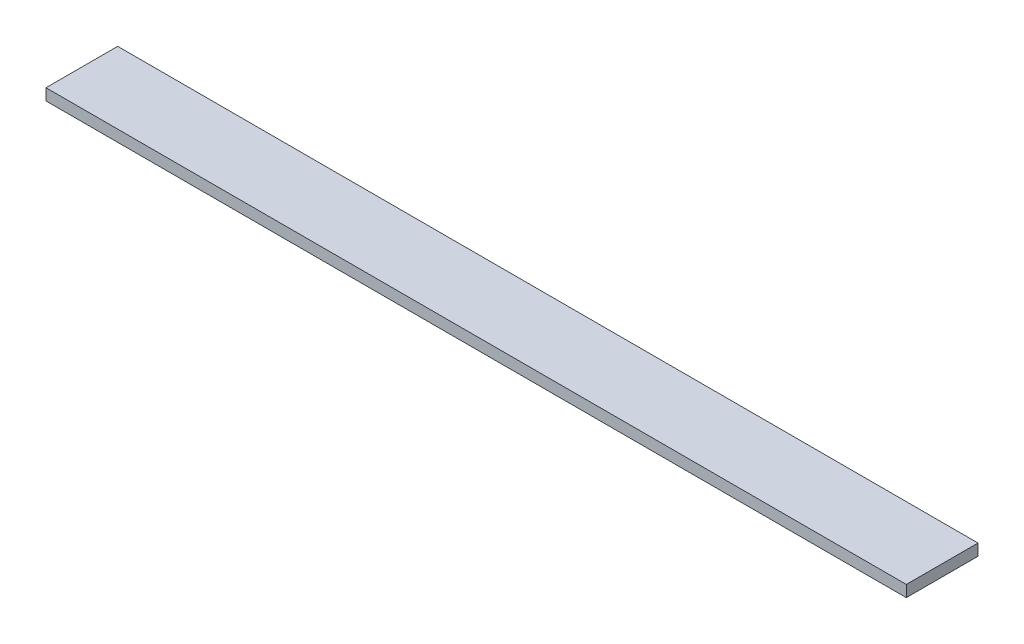
ISO-10303-21;
HEADER;
FILE_DESCRIPTION(('STEP AP214'),'2;1');
FILE_NAME('part.step','',(''),(''),'','','');
FILE_SCHEMA(('AUTOMOTIVE_DESIGN { 1 0 10303 214 1 1 1 1 }'));
ENDSEC;
DATA;
#1=APPLICATION_CONTEXT('core data for automotive mechanical design processes');
#2=APPLICATION_PROTOCOL_DEFINITION('international standard','automotive_design',2000,#1);
#3=PRODUCT_CONTEXT('',#1,'mechanical');
#4=PRODUCT('Part','Part','',(#3));
#5=PRODUCT_RELATED_PRODUCT_CATEGORY('part','',(#4));
#6=PRODUCT_DEFINITION_FORMATION('','',#4);
#7=PRODUCT_DEFINITION_CONTEXT('part definition',#1,'design');
#8=PRODUCT_DEFINITION('design','',#6,#7);
#9=PRODUCT_DEFINITION_SHAPE('','',#8);
#10=(LENGTH_UNIT() NAMED_UNIT(*) SI_UNIT(.MILLI.,.METRE.));
#11=(NAMED_UNIT(*) PLANE_ANGLE_UNIT() SI_UNIT($,.RADIAN.));
#12=(NAMED_UNIT(*) SI_UNIT($,.STERADIAN.) SOLID_ANGLE_UNIT());
#13=UNCERTAINTY_MEASURE_WITH_UNIT(LENGTH_MEASURE(1.E-05),#10,'distance_accuracy_value','');
#14=(GEOMETRIC_REPRESENTATION_CONTEXT(3) GLOBAL_UNCERTAINTY_ASSIGNED_CONTEXT((#13)) GLOBAL_UNIT_ASSIGNED_CONTEXT((#10,
#11,#12)) REPRESENTATION_CONTEXT('',''));
#15=CARTESIAN_POINT('',(0.,0.,0.));
#16=DIRECTION('',(0.,0.,1.));
#17=DIRECTION('',(1.,0.,0.));
#18=AXIS2_PLACEMENT_3D('',#15,#16,#17);
#19=CARTESIAN_POINT('',(300.,8.,-25.));
#20=DIRECTION('',(-1.,0.,0.));
#21=DIRECTION('',(0.,0.,1.));
#22=AXIS2_PLACEMENT_3D('',#19,#20,#21);
#23=PLANE('',#22);
#24=DIRECTION('',(0.,0.,-1.));
#25=VECTOR('',#24,1.);
#26=CARTESIAN_POINT('',(300.,0.,-25.));
#27=LINE('',#26,#25);
#28=CARTESIAN_POINT('',(300.,0.,25.));
#29=VERTEX_POINT('',#28);
#30=CARTESIAN_POINT('',(300.,0.,-25.));
#31=VERTEX_POINT('',#30);
#32=EDGE_CURVE('E100',#29,#31,#27,.T.);
#33=ORIENTED_EDGE('',*,*,#32,.T.);
#34=DIRECTION('',(0.,-1.,0.));
#35=VECTOR('',#34,1.);
#36=CARTESIAN_POINT('',(300.,8.,-25.));
#37=LINE('',#36,#35);
#38=CARTESIAN_POINT('',(300.,8.,-25.));
#39=VERTEX_POINT('',#38);
#40=EDGE_CURVE('E11',#39,#31,#37,.T.);
#41=ORIENTED_EDGE('',*,*,#40,.F.);
#42=DIRECTION('',(0.,0.,-1.));
#43=VECTOR('',#42,1.);
#44=CARTESIAN_POINT('',(300.,8.,-25.));
#45=LINE('',#44,#43);
#46=CARTESIAN_POINT('',(300.,8.,25.));
#47=VERTEX_POINT('',#46);
#48=EDGE_CURVE('E88',#47,#39,#45,.T.);
#49=ORIENTED_EDGE('',*,*,#48,.F.);
#50=DIRECTION('',(0.,-1.,0.));
#51=VECTOR('',#50,1.);
#52=CARTESIAN_POINT('',(300.,8.,25.));
#53=LINE('',#52,#51);
#54=EDGE_CURVE('E96',#47,#29,#53,.T.);
#55=ORIENTED_EDGE('',*,*,#54,.T.);
#56=EDGE_LOOP('',(#33,#41,#49,#55));
#57=FACE_BOUND('',#56,.T.);
#58=ADVANCED_FACE('F37',(#57),#23,.F.);
#59=CARTESIAN_POINT('',(-300.,8.,-25.));
#60=DIRECTION('',(0.,0.,1.));
#61=DIRECTION('',(1.,0.,0.));
#62=AXIS2_PLACEMENT_3D('',#59,#60,#61);
#63=PLANE('',#62);
#64=DIRECTION('',(-1.,0.,0.));
#65=VECTOR('',#64,1.);
#66=CARTESIAN_POINT('',(-300.,0.,-25.));
#67=LINE('',#66,#65);
#68=CARTESIAN_POINT('',(-300.,0.,-25.));
#69=VERTEX_POINT('',#68);
#70=EDGE_CURVE('E92',#31,#69,#67,.T.);
#71=ORIENTED_EDGE('',*,*,#70,.T.);
#72=DIRECTION('',(0.,-1.,0.));
#73=VECTOR('',#72,1.);
#74=CARTESIAN_POINT('',(-300.,8.,-25.));
#75=LINE('',#74,#73);
#76=CARTESIAN_POINT('',(-300.,8.,-25.));
#77=VERTEX_POINT('',#76);
#78=EDGE_CURVE('E45',#77,#69,#75,.T.);
#79=ORIENTED_EDGE('',*,*,#78,.F.);
#80=DIRECTION('',(-1.,0.,0.));
#81=VECTOR('',#80,1.);
#82=CARTESIAN_POINT('',(-300.,8.,-25.));
#83=LINE('',#82,#81);
#84=EDGE_CURVE('E83',#39,#77,#83,.T.);
#85=ORIENTED_EDGE('',*,*,#84,.F.);
#86=ORIENTED_EDGE('',*,*,#40,.T.);
#87=EDGE_LOOP('',(#71,#79,#85,#86));
#88=FACE_BOUND('',#87,.T.);
#89=ADVANCED_FACE('F91',(#88),#63,.F.);
#90=CARTESIAN_POINT('',(-300.,8.,-25.));
#91=DIRECTION('',(1.,0.,0.));
#92=DIRECTION('',(0.,0.,-1.));
#93=AXIS2_PLACEMENT_3D('',#90,#91,#92);
#94=PLANE('',#93);
#95=DIRECTION('',(0.,0.,1.));
#96=VECTOR('',#95,1.);
#97=CARTESIAN_POINT('',(-300.,0.,-25.));
#98=LINE('',#97,#96);
#99=CARTESIAN_POINT('',(-300.,0.,25.));
#100=VERTEX_POINT('',#99);
#101=EDGE_CURVE('E70',#69,#100,#98,.T.);
#102=ORIENTED_EDGE('',*,*,#101,.T.);
#103=DIRECTION('',(0.,-1.,0.));
#104=VECTOR('',#103,1.);
#105=CARTESIAN_POINT('',(-300.,8.,25.));
#106=LINE('',#105,#104);
#107=CARTESIAN_POINT('',(-300.,8.,25.));
#108=VERTEX_POINT('',#107);
#109=EDGE_CURVE('E93',#108,#100,#106,.T.);
#110=ORIENTED_EDGE('',*,*,#109,.F.);
#111=DIRECTION('',(0.,0.,1.));
#112=VECTOR('',#111,1.);
#113=CARTESIAN_POINT('',(-300.,8.,-25.));
#114=LINE('',#113,#112);
#115=EDGE_CURVE('E86',#77,#108,#114,.T.);
#116=ORIENTED_EDGE('',*,*,#115,.F.);
#117=ORIENTED_EDGE('',*,*,#78,.T.);
#118=EDGE_LOOP('',(#102,#110,#116,#117));
#119=FACE_BOUND('',#118,.T.);
#120=ADVANCED_FACE('F94',(#119),#94,.F.);
#121=CARTESIAN_POINT('',(-300.,8.,25.));
#122=DIRECTION('',(0.,0.,-1.));
#123=DIRECTION('',(-1.,0.,0.));
#124=AXIS2_PLACEMENT_3D('',#121,#122,#123);
#125=PLANE('',#124);
#126=DIRECTION('',(1.,0.,0.));
#127=VECTOR('',#126,1.);
#128=CARTESIAN_POINT('',(-300.,0.,25.));
#129=LINE('',#128,#127);
#130=EDGE_CURVE('E76',#100,#29,#129,.T.);
#131=ORIENTED_EDGE('',*,*,#130,.T.);
#132=ORIENTED_EDGE('',*,*,#54,.F.);
#133=DIRECTION('',(1.,0.,0.));
#134=VECTOR('',#133,1.);
#135=CARTESIAN_POINT('',(-300.,8.,25.));
#136=LINE('',#135,#134);
#137=EDGE_CURVE('E53',#108,#47,#136,.T.);
#138=ORIENTED_EDGE('',*,*,#137,.F.);
#139=ORIENTED_EDGE('',*,*,#109,.T.);
#140=EDGE_LOOP('',(#131,#132,#138,#139));
#141=FACE_BOUND('',#140,.T.);
#142=ADVANCED_FACE('F107',(#141),#125,.F.);
#143=CARTESIAN_POINT('',(0.,8.,0.));
#144=DIRECTION('',(0.,1.,0.));
#145=DIRECTION('',(0.,0.,1.));
#146=AXIS2_PLACEMENT_3D('',#143,#144,#145);
#147=PLANE('',#146);
#148=ORIENTED_EDGE('',*,*,#48,.T.);
#149=ORIENTED_EDGE('',*,*,#84,.T.);
#150=ORIENTED_EDGE('',*,*,#115,.T.);
#151=ORIENTED_EDGE('',*,*,#137,.T.);
#152=EDGE_LOOP('',(#148,#149,#150,#151));
#153=FACE_BOUND('',#152,.T.);
#154=ADVANCED_FACE('F84',(#153),#147,.T.);
#155=CARTESIAN_POINT('',(0.,0.,0.));
#156=DIRECTION('',(0.,1.,0.));
#157=DIRECTION('',(0.,0.,1.));
#158=AXIS2_PLACEMENT_3D('',#155,#156,#157);
#159=PLANE('',#158);
#160=ORIENTED_EDGE('',*,*,#32,.F.);
#161=ORIENTED_EDGE('',*,*,#130,.F.);
#162=ORIENTED_EDGE('',*,*,#101,.F.);
#163=ORIENTED_EDGE('',*,*,#70,.F.);
#164=EDGE_LOOP('',(#160,#161,#162,#163));
#165=FACE_BOUND('',#164,.T.);
#166=ADVANCED_FACE('F110',(#165),#159,.F.);
#167=CLOSED_SHELL('',(#58,#89,#120,#142,#154,#166));
#168=MANIFOLD_SOLID_BREP('B2',#167);
#169=ADVANCED_BREP_SHAPE_REPRESENTATION('',(#18,#168),#14);
#170=SHAPE_DEFINITION_REPRESENTATION(#9,#169);
ENDSEC;
END-ISO-10303-21;
